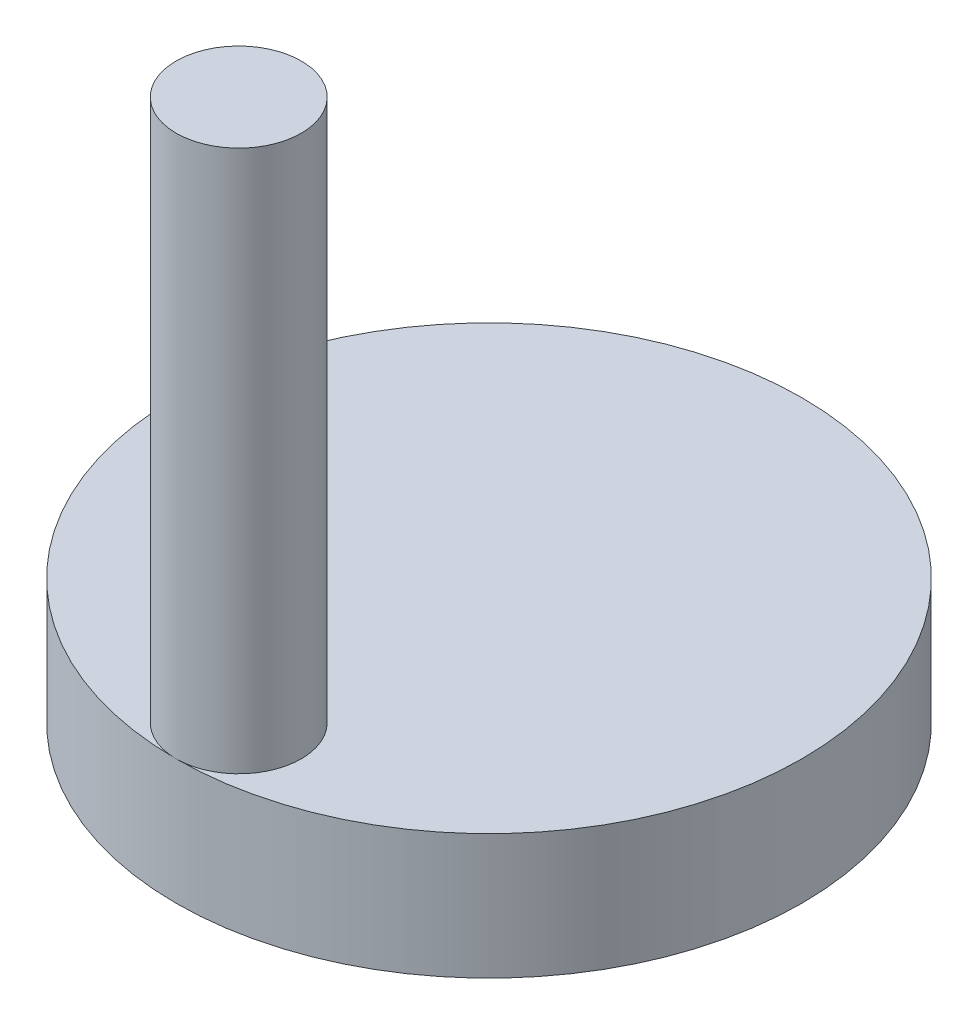
ISO-10303-21;
HEADER;
FILE_DESCRIPTION(('STEP AP214'),'2;1');
FILE_NAME('part.step','',(''),(''),'','','');
FILE_SCHEMA(('AUTOMOTIVE_DESIGN { 1 0 10303 214 1 1 1 1 }'));
ENDSEC;
DATA;
#1=APPLICATION_CONTEXT('core data for automotive mechanical design processes');
#2=APPLICATION_PROTOCOL_DEFINITION('international standard','automotive_design',2000,#1);
#3=PRODUCT_CONTEXT('',#1,'mechanical');
#4=PRODUCT('Part','Part','',(#3));
#5=PRODUCT_RELATED_PRODUCT_CATEGORY('part','',(#4));
#6=PRODUCT_DEFINITION_FORMATION('','',#4);
#7=PRODUCT_DEFINITION_CONTEXT('part definition',#1,'design');
#8=PRODUCT_DEFINITION('design','',#6,#7);
#9=PRODUCT_DEFINITION_SHAPE('','',#8);
#10=(LENGTH_UNIT() NAMED_UNIT(*) SI_UNIT(.MILLI.,.METRE.));
#11=(NAMED_UNIT(*) PLANE_ANGLE_UNIT() SI_UNIT($,.RADIAN.));
#12=(NAMED_UNIT(*) SI_UNIT($,.STERADIAN.) SOLID_ANGLE_UNIT());
#13=UNCERTAINTY_MEASURE_WITH_UNIT(LENGTH_MEASURE(1.E-05),#10,'distance_accuracy_value','');
#14=(GEOMETRIC_REPRESENTATION_CONTEXT(3) GLOBAL_UNCERTAINTY_ASSIGNED_CONTEXT((#13)) GLOBAL_UNIT_ASSIGNED_CONTEXT((#10,
#11,#12)) REPRESENTATION_CONTEXT('',''));
#15=CARTESIAN_POINT('',(0.,0.,0.));
#16=DIRECTION('',(0.,0.,1.));
#17=DIRECTION('',(1.,0.,0.));
#18=AXIS2_PLACEMENT_3D('',#15,#16,#17);
#19=CARTESIAN_POINT('',(0.,10.,0.));
#20=DIRECTION('',(0.,-1.,0.));
#21=DIRECTION('',(0.,0.,-1.));
#22=AXIS2_PLACEMENT_3D('',#19,#20,#21);
#23=CYLINDRICAL_SURFACE('',#22,25.);
#24=CARTESIAN_POINT('',(0.,10.,0.));
#25=DIRECTION('',(0.,1.,0.));
#26=DIRECTION('',(0.,0.,1.));
#27=AXIS2_PLACEMENT_3D('',#24,#25,#26);
#28=CIRCLE('',#27,25.);
#29=CARTESIAN_POINT('',(0.,10.,25.));
#30=VERTEX_POINT('',#29);
#31=EDGE_CURVE('E11',#30,#30,#28,.T.);
#32=ORIENTED_EDGE('',*,*,#31,.F.);
#33=EDGE_LOOP('',(#32));
#34=FACE_BOUND('',#33,.T.);
#35=CARTESIAN_POINT('',(0.,0.,0.));
#36=DIRECTION('',(0.,1.,0.));
#37=DIRECTION('',(0.,0.,1.));
#38=AXIS2_PLACEMENT_3D('',#35,#36,#37);
#39=CIRCLE('',#38,25.);
#40=CARTESIAN_POINT('',(0.,0.,25.));
#41=VERTEX_POINT('',#40);
#42=EDGE_CURVE('E39',#41,#41,#39,.T.);
#43=ORIENTED_EDGE('',*,*,#42,.T.);
#44=EDGE_LOOP('',(#43));
#45=FACE_BOUND('',#44,.T.);
#46=ADVANCED_FACE('F36',(#34,#45),#23,.T.);
#47=CARTESIAN_POINT('',(0.,10.,0.));
#48=DIRECTION('',(0.,1.,0.));
#49=DIRECTION('',(0.,0.,1.));
#50=AXIS2_PLACEMENT_3D('',#47,#48,#49);
#51=PLANE('',#50);
#52=ORIENTED_EDGE('',*,*,#31,.T.);
#53=CARTESIAN_POINT('',(0.,10.,20.));
#54=DIRECTION('',(0.,1.,0.));
#55=DIRECTION('',(0.,0.,1.));
#56=AXIS2_PLACEMENT_3D('',#53,#54,#55);
#57=CIRCLE('',#56,5.);
#58=EDGE_CURVE('E50',#30,#30,#57,.T.);
#59=ORIENTED_EDGE('',*,*,#58,.F.);
#60=EDGE_LOOP('',(#52,#59));
#61=FACE_BOUND('',#60,.T.);
#62=ADVANCED_FACE('F48',(#61),#51,.T.);
#63=CARTESIAN_POINT('',(0.,0.,0.));
#64=DIRECTION('',(0.,1.,0.));
#65=DIRECTION('',(0.,0.,1.));
#66=AXIS2_PLACEMENT_3D('',#63,#64,#65);
#67=PLANE('',#66);
#68=ORIENTED_EDGE('',*,*,#42,.F.);
#69=EDGE_LOOP('',(#68));
#70=FACE_BOUND('',#69,.T.);
#71=ADVANCED_FACE('F61',(#70),#67,.F.);
#72=CARTESIAN_POINT('',(0.,67.442135623731,20.));
#73=DIRECTION('',(0.,-1.,0.));
#74=DIRECTION('',(0.,0.,-1.));
#75=AXIS2_PLACEMENT_3D('',#72,#73,#74);
#76=CYLINDRICAL_SURFACE('',#75,5.);
#77=ORIENTED_EDGE('',*,*,#58,.T.);
#78=EDGE_LOOP('',(#77));
#79=FACE_BOUND('',#78,.T.);
#80=CARTESIAN_POINT('',(0.,53.3,20.));
#81=DIRECTION('',(0.,1.,0.));
#82=DIRECTION('',(0.,0.,1.));
#83=AXIS2_PLACEMENT_3D('',#80,#81,#82);
#84=CIRCLE('',#83,5.);
#85=CARTESIAN_POINT('',(0.,53.3,25.));
#86=VERTEX_POINT('',#85);
#87=EDGE_CURVE('E52',#86,#86,#84,.T.);
#88=ORIENTED_EDGE('',*,*,#87,.F.);
#89=EDGE_LOOP('',(#88));
#90=FACE_BOUND('',#89,.T.);
#91=ADVANCED_FACE('F63',(#79,#90),#76,.T.);
#92=CARTESIAN_POINT('',(0.,53.3,0.));
#93=DIRECTION('',(0.,1.,0.));
#94=DIRECTION('',(0.,0.,1.));
#95=AXIS2_PLACEMENT_3D('',#92,#93,#94);
#96=PLANE('',#95);
#97=ORIENTED_EDGE('',*,*,#87,.T.);
#98=EDGE_LOOP('',(#97));
#99=FACE_BOUND('',#98,.T.);
#100=ADVANCED_FACE('F68',(#99),#96,.T.);
#101=CLOSED_SHELL('',(#46,#62,#71,#91,#100));
#102=MANIFOLD_SOLID_BREP('B2',#101);
#103=ADVANCED_BREP_SHAPE_REPRESENTATION('',(#18,#102),#14);
#104=SHAPE_DEFINITION_REPRESENTATION(#9,#103);
ENDSEC;
END-ISO-10303-21;
